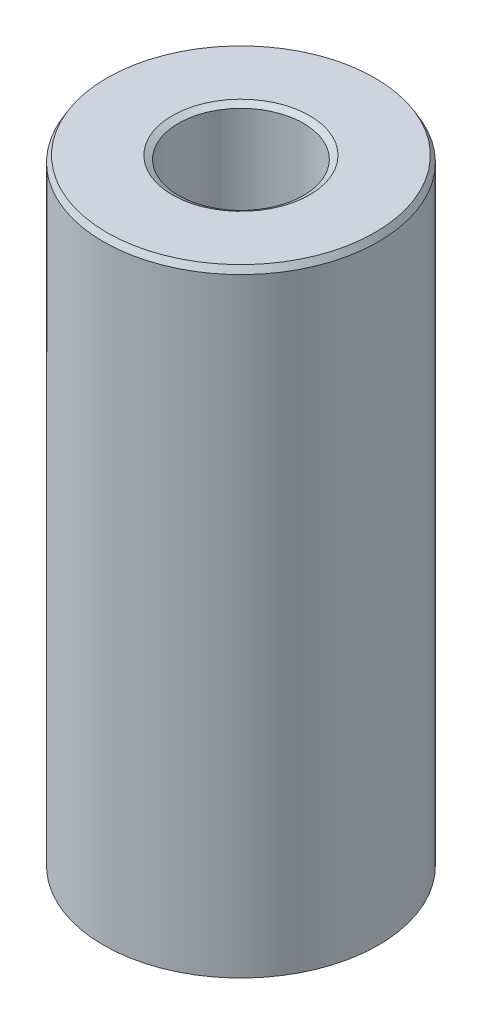
ISO-10303-21;
HEADER;
FILE_DESCRIPTION(('STEP AP214'),'2;1');
FILE_NAME('part.step','',(''),(''),'','','');
FILE_SCHEMA(('AUTOMOTIVE_DESIGN { 1 0 10303 214 1 1 1 1 }'));
ENDSEC;
DATA;
#1=APPLICATION_CONTEXT('core data for automotive mechanical design processes');
#2=APPLICATION_PROTOCOL_DEFINITION('international standard','automotive_design',2000,#1);
#3=PRODUCT_CONTEXT('',#1,'mechanical');
#4=PRODUCT('Part','Part','',(#3));
#5=PRODUCT_RELATED_PRODUCT_CATEGORY('part','',(#4));
#6=PRODUCT_DEFINITION_FORMATION('','',#4);
#7=PRODUCT_DEFINITION_CONTEXT('part definition',#1,'design');
#8=PRODUCT_DEFINITION('design','',#6,#7);
#9=PRODUCT_DEFINITION_SHAPE('','',#8);
#10=(LENGTH_UNIT() NAMED_UNIT(*) SI_UNIT(.MILLI.,.METRE.));
#11=(NAMED_UNIT(*) PLANE_ANGLE_UNIT() SI_UNIT($,.RADIAN.));
#12=(NAMED_UNIT(*) SI_UNIT($,.STERADIAN.) SOLID_ANGLE_UNIT());
#13=UNCERTAINTY_MEASURE_WITH_UNIT(LENGTH_MEASURE(1.E-05),#10,'distance_accuracy_value','');
#14=(GEOMETRIC_REPRESENTATION_CONTEXT(3) GLOBAL_UNCERTAINTY_ASSIGNED_CONTEXT((#13)) GLOBAL_UNIT_ASSIGNED_CONTEXT((#10,
#11,#12)) REPRESENTATION_CONTEXT('',''));
#15=CARTESIAN_POINT('',(0.,0.,0.));
#16=DIRECTION('',(0.,0.,1.));
#17=DIRECTION('',(1.,0.,0.));
#18=AXIS2_PLACEMENT_3D('',#15,#16,#17);
#19=CARTESIAN_POINT('',(0.,202.538941809686,0.));
#20=DIRECTION('',(0.,-1.,0.));
#21=DIRECTION('',(0.,0.,-1.));
#22=AXIS2_PLACEMENT_3D('',#19,#20,#21);
#23=CYLINDRICAL_SURFACE('',#22,45.);
#24=CARTESIAN_POINT('',(0.,1.16147507523207,0.));
#25=DIRECTION('',(0.,1.,0.));
#26=DIRECTION('',(0.,0.,1.));
#27=AXIS2_PLACEMENT_3D('',#24,#25,#26);
#28=CIRCLE('',#27,45.);
#29=CARTESIAN_POINT('',(0.,1.16147507523207,45.));
#30=VERTEX_POINT('',#29);
#31=EDGE_CURVE('E10',#30,#30,#28,.T.);
#32=ORIENTED_EDGE('',*,*,#31,.T.);
#33=EDGE_LOOP('',(#32));
#34=FACE_BOUND('',#33,.T.);
#35=CARTESIAN_POINT('',(0.,200.527207967659,0.));
#36=DIRECTION('',(0.,1.,0.));
#37=DIRECTION('',(0.,0.,1.));
#38=AXIS2_PLACEMENT_3D('',#35,#36,#37);
#39=CIRCLE('',#38,45.);
#40=CARTESIAN_POINT('',(0.,200.527207967659,45.));
#41=VERTEX_POINT('',#40);
#42=EDGE_CURVE('E50',#41,#41,#39,.F.);
#43=ORIENTED_EDGE('',*,*,#42,.T.);
#44=EDGE_LOOP('',(#43));
#45=FACE_BOUND('',#44,.T.);
#46=ADVANCED_FACE('F39',(#34,#45),#23,.T.);
#47=CARTESIAN_POINT('',(0.,202.538941809686,0.));
#48=DIRECTION('',(0.,1.,0.));
#49=DIRECTION('',(0.,0.,1.));
#50=AXIS2_PLACEMENT_3D('',#47,#48,#49);
#51=PLANE('',#50);
#52=CARTESIAN_POINT('',(0.,202.538941809686,0.));
#53=DIRECTION('',(0.,1.,0.));
#54=DIRECTION('',(0.,0.,1.));
#55=AXIS2_PLACEMENT_3D('',#52,#53,#54);
#56=CIRCLE('',#55,22.4778486962886);
#57=CARTESIAN_POINT('',(0.,202.538941809686,22.4778486962886));
#58=VERTEX_POINT('',#57);
#59=EDGE_CURVE('E58',#58,#58,#56,.F.);
#60=ORIENTED_EDGE('',*,*,#59,.T.);
#61=EDGE_LOOP('',(#60));
#62=FACE_BOUND('',#61,.T.);
#63=CARTESIAN_POINT('',(0.,202.538941809686,0.));
#64=DIRECTION('',(0.,1.,0.));
#65=DIRECTION('',(0.,0.,1.));
#66=AXIS2_PLACEMENT_3D('',#63,#64,#65);
#67=CIRCLE('',#66,43.8385249247679);
#68=CARTESIAN_POINT('',(0.,202.538941809686,43.8385249247679));
#69=VERTEX_POINT('',#68);
#70=EDGE_CURVE('E61',#69,#69,#67,.T.);
#71=ORIENTED_EDGE('',*,*,#70,.T.);
#72=EDGE_LOOP('',(#71));
#73=FACE_BOUND('',#72,.T.);
#74=ADVANCED_FACE('F88',(#62,#73),#51,.T.);
#75=CARTESIAN_POINT('',(0.,0.,0.));
#76=DIRECTION('',(0.,1.,0.));
#77=DIRECTION('',(0.,0.,1.));
#78=AXIS2_PLACEMENT_3D('',#75,#76,#77);
#79=PLANE('',#78);
#80=CARTESIAN_POINT('',(0.,0.,0.));
#81=DIRECTION('',(0.,1.,0.));
#82=DIRECTION('',(0.,0.,1.));
#83=AXIS2_PLACEMENT_3D('',#80,#81,#82);
#84=CIRCLE('',#83,21.6275899294939);
#85=CARTESIAN_POINT('',(0.,0.,21.6275899294939));
#86=VERTEX_POINT('',#85);
#87=EDGE_CURVE('E51',#86,#86,#84,.T.);
#88=ORIENTED_EDGE('',*,*,#87,.T.);
#89=EDGE_LOOP('',(#88));
#90=FACE_BOUND('',#89,.T.);
#91=CARTESIAN_POINT('',(0.,0.,0.));
#92=DIRECTION('',(0.,1.,0.));
#93=DIRECTION('',(0.,0.,1.));
#94=AXIS2_PLACEMENT_3D('',#91,#92,#93);
#95=CIRCLE('',#94,42.9882661579732);
#96=CARTESIAN_POINT('',(0.,0.,42.9882661579732));
#97=VERTEX_POINT('',#96);
#98=EDGE_CURVE('E54',#97,#97,#95,.F.);
#99=ORIENTED_EDGE('',*,*,#98,.T.);
#100=EDGE_LOOP('',(#99));
#101=FACE_BOUND('',#100,.T.);
#102=ADVANCED_FACE('F83',(#90,#101),#79,.F.);
#103=CARTESIAN_POINT('',(0.,202.538941809686,0.));
#104=DIRECTION('',(0.,-1.,0.));
#105=DIRECTION('',(0.,0.,-1.));
#106=AXIS2_PLACEMENT_3D('',#103,#104,#105);
#107=CYLINDRICAL_SURFACE('',#106,20.4661148542618);
#108=CARTESIAN_POINT('',(0.,201.377466734454,0.));
#109=DIRECTION('',(0.,1.,0.));
#110=DIRECTION('',(0.,0.,1.));
#111=AXIS2_PLACEMENT_3D('',#108,#109,#110);
#112=CIRCLE('',#111,20.4661148542618);
#113=CARTESIAN_POINT('',(0.,201.377466734454,20.4661148542618));
#114=VERTEX_POINT('',#113);
#115=EDGE_CURVE('E67',#114,#114,#112,.T.);
#116=ORIENTED_EDGE('',*,*,#115,.T.);
#117=EDGE_LOOP('',(#116));
#118=FACE_BOUND('',#117,.T.);
#119=CARTESIAN_POINT('',(0.,2.01173384202688,0.));
#120=DIRECTION('',(0.,1.,0.));
#121=DIRECTION('',(0.,0.,1.));
#122=AXIS2_PLACEMENT_3D('',#119,#120,#121);
#123=CIRCLE('',#122,20.4661148542618);
#124=CARTESIAN_POINT('',(0.,2.01173384202688,20.4661148542618));
#125=VERTEX_POINT('',#124);
#126=EDGE_CURVE('E69',#125,#125,#123,.F.);
#127=ORIENTED_EDGE('',*,*,#126,.T.);
#128=EDGE_LOOP('',(#127));
#129=FACE_BOUND('',#128,.T.);
#130=ADVANCED_FACE('F71',(#118,#129),#107,.F.);
#131=CARTESIAN_POINT('',(0.,201.377466734454,0.));
#132=DIRECTION('',(0.,1.,0.));
#133=DIRECTION('',(0.,0.,1.));
#134=AXIS2_PLACEMENT_3D('',#131,#132,#133);
#135=CONICAL_SURFACE('',#134,20.4661148542618,1.0471975511966);
#136=ORIENTED_EDGE('',*,*,#59,.F.);
#137=EDGE_LOOP('',(#136));
#138=FACE_BOUND('',#137,.T.);
#139=ORIENTED_EDGE('',*,*,#115,.F.);
#140=EDGE_LOOP('',(#139));
#141=FACE_BOUND('',#140,.T.);
#142=ADVANCED_FACE('F77',(#138,#141),#135,.F.);
#143=CARTESIAN_POINT('',(0.,0.,0.));
#144=DIRECTION('',(0.,-1.,0.));
#145=DIRECTION('',(0.,0.,-1.));
#146=AXIS2_PLACEMENT_3D('',#143,#144,#145);
#147=CONICAL_SURFACE('',#146,21.6275899294939,0.523598775598294);
#148=ORIENTED_EDGE('',*,*,#126,.F.);
#149=EDGE_LOOP('',(#148));
#150=FACE_BOUND('',#149,.T.);
#151=ORIENTED_EDGE('',*,*,#87,.F.);
#152=EDGE_LOOP('',(#151));
#153=FACE_BOUND('',#152,.T.);
#154=ADVANCED_FACE('F73',(#150,#153),#147,.F.);
#155=CARTESIAN_POINT('',(0.,1.16147507523207,0.));
#156=DIRECTION('',(0.,1.,0.));
#157=DIRECTION('',(0.,0.,1.));
#158=AXIS2_PLACEMENT_3D('',#155,#156,#157);
#159=CONICAL_SURFACE('',#158,45.,1.0471975511966);
#160=ORIENTED_EDGE('',*,*,#98,.F.);
#161=EDGE_LOOP('',(#160));
#162=FACE_BOUND('',#161,.T.);
#163=ORIENTED_EDGE('',*,*,#31,.F.);
#164=EDGE_LOOP('',(#163));
#165=FACE_BOUND('',#164,.T.);
#166=ADVANCED_FACE('F76',(#162,#165),#159,.T.);
#167=CARTESIAN_POINT('',(0.,202.538941809686,0.));
#168=DIRECTION('',(0.,-1.,0.));
#169=DIRECTION('',(0.,0.,-1.));
#170=AXIS2_PLACEMENT_3D('',#167,#168,#169);
#171=CONICAL_SURFACE('',#170,43.8385249247679,0.523598775598296);
#172=ORIENTED_EDGE('',*,*,#42,.F.);
#173=EDGE_LOOP('',(#172));
#174=FACE_BOUND('',#173,.T.);
#175=ORIENTED_EDGE('',*,*,#70,.F.);
#176=EDGE_LOOP('',(#175));
#177=FACE_BOUND('',#176,.T.);
#178=ADVANCED_FACE('F45',(#174,#177),#171,.T.);
#179=CLOSED_SHELL('',(#46,#74,#102,#130,#142,#154,#166,#178));
#180=MANIFOLD_SOLID_BREP('B2',#179);
#181=ADVANCED_BREP_SHAPE_REPRESENTATION('',(#18,#180),#14);
#182=SHAPE_DEFINITION_REPRESENTATION(#9,#181);
ENDSEC;
END-ISO-10303-21;
